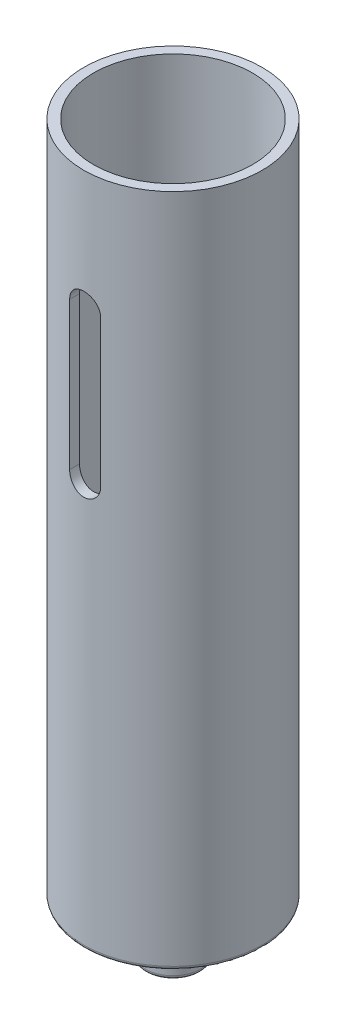
ISO-10303-21;
HEADER;
FILE_DESCRIPTION(('STEP AP214'),'2;1');
FILE_NAME('part.step','',(''),(''),'','','');
FILE_SCHEMA(('AUTOMOTIVE_DESIGN { 1 0 10303 214 1 1 1 1 }'));
ENDSEC;
DATA;
#1=APPLICATION_CONTEXT('core data for automotive mechanical design processes');
#2=APPLICATION_PROTOCOL_DEFINITION('international standard','automotive_design',2000,#1);
#3=PRODUCT_CONTEXT('',#1,'mechanical');
#4=PRODUCT('Part','Part','',(#3));
#5=PRODUCT_RELATED_PRODUCT_CATEGORY('part','',(#4));
#6=PRODUCT_DEFINITION_FORMATION('','',#4);
#7=PRODUCT_DEFINITION_CONTEXT('part definition',#1,'design');
#8=PRODUCT_DEFINITION('design','',#6,#7);
#9=PRODUCT_DEFINITION_SHAPE('','',#8);
#10=(LENGTH_UNIT() NAMED_UNIT(*) SI_UNIT(.MILLI.,.METRE.));
#11=(NAMED_UNIT(*) PLANE_ANGLE_UNIT() SI_UNIT($,.RADIAN.));
#12=(NAMED_UNIT(*) SI_UNIT($,.STERADIAN.) SOLID_ANGLE_UNIT());
#13=UNCERTAINTY_MEASURE_WITH_UNIT(LENGTH_MEASURE(1.E-05),#10,'distance_accuracy_value','');
#14=(GEOMETRIC_REPRESENTATION_CONTEXT(3) GLOBAL_UNCERTAINTY_ASSIGNED_CONTEXT((#13)) GLOBAL_UNIT_ASSIGNED_CONTEXT((#10,
#11,#12)) REPRESENTATION_CONTEXT('',''));
#15=CARTESIAN_POINT('',(0.,0.,0.));
#16=DIRECTION('',(0.,0.,1.));
#17=DIRECTION('',(1.,0.,0.));
#18=AXIS2_PLACEMENT_3D('',#15,#16,#17);
#19=CARTESIAN_POINT('',(0.,87.,0.));
#20=DIRECTION('',(0.,-1.,0.));
#21=DIRECTION('',(0.,0.,-1.));
#22=AXIS2_PLACEMENT_3D('',#19,#20,#21);
#23=CYLINDRICAL_SURFACE('',#22,10.25);
#24=CARTESIAN_POINT('',(2.,52.5,10.0529846314416));
#25=CARTESIAN_POINT('',(2.00000026474774,52.4443037438582,10.0529818512377));
#26=CARTESIAN_POINT('',(1.99767197114106,52.3886347089901,10.0534480792729));
#27=CARTESIAN_POINT('',(1.98838764643216,52.2777056971872,10.055289542273));
#28=CARTESIAN_POINT('',(1.98143217044959,52.2224456719878,10.056664668198));
#29=CARTESIAN_POINT('',(1.95371202827703,52.0580508314354,10.06210146268));
#30=CARTESIAN_POINT('',(1.92609332187398,51.9500341345624,10.0674748189029));
#31=CARTESIAN_POINT('',(1.85342199518341,51.7402849984717,10.0811048819969));
#32=CARTESIAN_POINT('',(1.80836714859896,51.6385533636732,10.0893619570564));
#33=CARTESIAN_POINT('',(1.70213759643023,51.4440639321559,10.1078248874847));
#34=CARTESIAN_POINT('',(1.64096144953581,51.3513069388209,10.1180309170755));
#35=CARTESIAN_POINT('',(1.50336058613172,51.1761961972561,10.1393933833315));
#36=CARTESIAN_POINT('',(1.42676233551179,51.093980059334,10.150559722467));
#37=CARTESIAN_POINT('',(1.26085794813628,50.9434708337091,10.172498541661));
#38=CARTESIAN_POINT('',(1.17154984994044,50.8751798989705,10.1832709606047));
#39=CARTESIAN_POINT('',(0.981850523573934,50.753934808158,10.2033145114834));
#40=CARTESIAN_POINT('',(0.881373816553729,50.7011120368576,10.212572503359));
#41=CARTESIAN_POINT('',(0.672766327683913,50.613152159665,10.2284315918507));
#42=CARTESIAN_POINT('',(0.564636648888219,50.5780125109298,10.2350330704475));
#43=CARTESIAN_POINT('',(0.345226874612462,50.5268430256144,10.2447655226638));
#44=CARTESIAN_POINT('',(0.234003304952567,50.5105790279144,10.2479389873593));
#45=CARTESIAN_POINT('',(0.01036136208437,50.4968922107862,10.2506045196876));
#46=CARTESIAN_POINT('',(-0.102056928601051,50.4994680983702,10.2500968399588));
#47=CARTESIAN_POINT('',(-0.323283785408644,50.5232102498542,10.2454901815369));
#48=CARTESIAN_POINT('',(-0.432120631896837,50.544123846148,10.2414400151616));
#49=CARTESIAN_POINT('',(-0.644709125095129,50.6035472900919,10.2302584409063));
#50=CARTESIAN_POINT('',(-0.748460611696426,50.642057691371,10.2231269360817));
#51=CARTESIAN_POINT('',(-0.948661299857947,50.7358189426263,10.2065029605881));
#52=CARTESIAN_POINT('',(-1.04506242449343,50.7911698539017,10.1969964403882));
#53=CARTESIAN_POINT('',(-1.22729891218388,50.9169653317526,10.1766722023355));
#54=CARTESIAN_POINT('',(-1.31313346298695,50.9874110575262,10.16585438381));
#55=CARTESIAN_POINT('',(-1.47329233366574,51.142774558763,10.1438928677922));
#56=CARTESIAN_POINT('',(-1.54740363577462,51.2279117158987,10.1327467378672));
#57=CARTESIAN_POINT('',(-1.68034975325842,51.4095455736973,10.1115514240507));
#58=CARTESIAN_POINT('',(-1.73918032150545,51.5060454216989,10.1015025455782));
#59=CARTESIAN_POINT('',(-1.83996499115779,51.7079761492387,10.0836335426808));
#60=CARTESIAN_POINT('',(-1.88187627333621,51.813428881313,10.0758190875049));
#61=CARTESIAN_POINT('',(-1.9472669955486,52.029997762423,10.0633879913991));
#62=CARTESIAN_POINT('',(-1.9707739021778,52.1411052074376,10.0587665863936));
#63=CARTESIAN_POINT('',(-1.98981842686514,52.294245366103,10.0550056000148));
#64=CARTESIAN_POINT('',(-1.99363788270108,52.3353358711925,10.0542485447647));
#65=CARTESIAN_POINT('',(-1.99872545093758,52.4176114368517,10.0532384947413));
#66=CARTESIAN_POINT('',(-1.99999783890398,52.4587962225864,10.0529846552656));
#67=CARTESIAN_POINT('',(-2.,52.5,10.0529846314416));
#68=B_SPLINE_CURVE_WITH_KNOTS('',3,(#24,#25,#26,#27,#28,#29,#30,#31,#32,#33,#34,#35,#36,#37,#38,
#39,#40,#41,#42,#43,#44,#45,#46,#47,#48,#49,#50,#51,#52,#53,#54,#55,#56,#57,#58,#59,#60,#61,#62,
#63,#64,#65,#66,#67),.UNSPECIFIED.,.F.,.F.,(4,2,2,2,2,2,2,2,2,2,2,2,2,2,2,2,2,2,2,2,2,4),(0.,
0.166984414418493,0.333948799451815,0.667086576052713,1.00026690269221,1.33347702712651,
1.67067021644531,2.00791549946079,2.34794732267791,2.68793023514507,3.02364883228466,
3.35934438915662,3.69048596299376,4.02163795589081,4.35479730819768,4.68798225447393,
5.02665849113204,5.36542875899523,5.70505108924443,6.0441655975835,6.1679265595979,
6.29147959886261),.UNSPECIFIED.);
#69=CARTESIAN_POINT('',(2.,52.5,10.0529846314416));
#70=VERTEX_POINT('',#69);
#71=CARTESIAN_POINT('',(-2.,52.5,10.0529846314416));
#72=VERTEX_POINT('',#71);
#73=EDGE_CURVE('E235',#70,#72,#68,.T.);
#74=ORIENTED_EDGE('',*,*,#73,.F.);
#75=DIRECTION('',(0.,-1.,0.));
#76=VECTOR('',#75,1.);
#77=CARTESIAN_POINT('',(2.,87.,10.0529846314416));
#78=LINE('',#77,#76);
#79=CARTESIAN_POINT('',(2.,71.5,10.0529846314416));
#80=VERTEX_POINT('',#79);
#81=EDGE_CURVE('E117',#80,#70,#78,.T.);
#82=ORIENTED_EDGE('',*,*,#81,.F.);
#83=CARTESIAN_POINT('',(-2.,71.5,10.0529846314416));
#84=CARTESIAN_POINT('',(-2.00000026474775,71.5556962561418,10.0529818512377));
#85=CARTESIAN_POINT('',(-1.99767197114107,71.6113652910098,10.0534480792729));
#86=CARTESIAN_POINT('',(-1.98838764643216,71.7222943028127,10.055289542273));
#87=CARTESIAN_POINT('',(-1.98143217044959,71.7775543280122,10.056664668198));
#88=CARTESIAN_POINT('',(-1.95371202827703,71.9419491685646,10.06210146268));
#89=CARTESIAN_POINT('',(-1.92609332187399,72.0499658654376,10.0674748189029));
#90=CARTESIAN_POINT('',(-1.85342199518342,72.2597150015283,10.0811048819969));
#91=CARTESIAN_POINT('',(-1.80836714859896,72.3614466363268,10.0893619570564));
#92=CARTESIAN_POINT('',(-1.70213759643023,72.5559360678441,10.1078248874847));
#93=CARTESIAN_POINT('',(-1.64096144953581,72.6486930611791,10.1180309170755));
#94=CARTESIAN_POINT('',(-1.50336058613172,72.8238038027439,10.1393933833315));
#95=CARTESIAN_POINT('',(-1.42676233551178,72.906019940666,10.150559722467));
#96=CARTESIAN_POINT('',(-1.26085794813628,73.0565291662909,10.172498541661));
#97=CARTESIAN_POINT('',(-1.17154984994044,73.1248201010295,10.1832709606047));
#98=CARTESIAN_POINT('',(-0.981850523573938,73.246065191842,10.2033145114834));
#99=CARTESIAN_POINT('',(-0.881373816553735,73.2988879631424,10.212572503359));
#100=CARTESIAN_POINT('',(-0.672766327683919,73.386847840335,10.2284315918507));
#101=CARTESIAN_POINT('',(-0.564636648888224,73.4219874890702,10.2350330704475));
#102=CARTESIAN_POINT('',(-0.345226874612466,73.4731569743855,10.2447655226638));
#103=CARTESIAN_POINT('',(-0.234003304952569,73.4894209720856,10.2479389873593));
#104=CARTESIAN_POINT('',(-0.0103613620843715,73.5031077892138,10.2506045196876));
#105=CARTESIAN_POINT('',(0.102056928601051,73.5005319016298,10.2500968399588));
#106=CARTESIAN_POINT('',(0.323283785408643,73.4767897501458,10.2454901815369));
#107=CARTESIAN_POINT('',(0.432120631896835,73.455876153852,10.2414400151616));
#108=CARTESIAN_POINT('',(0.644709125095127,73.396452709908,10.2302584409063));
#109=CARTESIAN_POINT('',(0.748460611696426,73.357942308629,10.2231269360817));
#110=CARTESIAN_POINT('',(0.94866129985795,73.2641810573737,10.2065029605881));
#111=CARTESIAN_POINT('',(1.04506242449343,73.2088301460983,10.1969964403882));
#112=CARTESIAN_POINT('',(1.22729891218389,73.0830346682474,10.1766722023355));
#113=CARTESIAN_POINT('',(1.31313346298695,73.0125889424738,10.16585438381));
#114=CARTESIAN_POINT('',(1.47329233366574,72.857225441237,10.1438928677922));
#115=CARTESIAN_POINT('',(1.54740363577463,72.7720882841013,10.1327467378672));
#116=CARTESIAN_POINT('',(1.68034975325843,72.5904544263027,10.1115514240507));
#117=CARTESIAN_POINT('',(1.73918032150545,72.493954578301,10.1015025455782));
#118=CARTESIAN_POINT('',(1.83996499115779,72.2920238507613,10.0836335426808));
#119=CARTESIAN_POINT('',(1.88187627333621,72.186571118687,10.0758190875049));
#120=CARTESIAN_POINT('',(1.9472669955486,71.970002237577,10.0633879913991));
#121=CARTESIAN_POINT('',(1.9707739021778,71.8588947925624,10.0587665863936));
#122=CARTESIAN_POINT('',(1.98981842686514,71.7057546338969,10.0550056000148));
#123=CARTESIAN_POINT('',(1.99363788270108,71.6646641288075,10.0542485447647));
#124=CARTESIAN_POINT('',(1.99872545093759,71.5823885631482,10.0532384947413));
#125=CARTESIAN_POINT('',(1.99999783890398,71.5412037774136,10.0529846552656));
#126=CARTESIAN_POINT('',(2.,71.5,10.0529846314416));
#127=B_SPLINE_CURVE_WITH_KNOTS('',3,(#83,#84,#85,#86,#87,#88,#89,#90,#91,#92,#93,#94,#95,#96,
#97,#98,#99,#100,#101,#102,#103,#104,#105,#106,#107,#108,#109,#110,#111,#112,#113,#114,#115,
#116,#117,#118,#119,#120,#121,#122,#123,#124,#125,#126),.UNSPECIFIED.,.F.,.F.,(4,2,2,2,2,2,2,2,
2,2,2,2,2,2,2,2,2,2,2,2,2,4),(0.,0.166984414418472,0.333948799451794,0.667086576052713,
1.00026690269221,1.33347702712653,1.67067021644531,2.00791549946079,2.3479473226779,
2.68793023514506,3.02364883228466,3.35934438915663,3.69048596299376,4.02163795589082,
4.3547973081977,4.68798225447394,5.02665849113205,5.36542875899524,5.70505108924441,
6.04416559758352,6.16792655959792,6.29147959886264),.UNSPECIFIED.);
#128=CARTESIAN_POINT('',(-2.,71.5,10.0529846314416));
#129=VERTEX_POINT('',#128);
#130=EDGE_CURVE('E134',#129,#80,#127,.T.);
#131=ORIENTED_EDGE('',*,*,#130,.F.);
#132=DIRECTION('',(0.,-1.,0.));
#133=VECTOR('',#132,1.);
#134=CARTESIAN_POINT('',(-2.,87.,10.0529846314416));
#135=LINE('',#134,#133);
#136=EDGE_CURVE('E138',#72,#129,#135,.F.);
#137=ORIENTED_EDGE('',*,*,#136,.F.);
#138=EDGE_LOOP('',(#74,#82,#131,#137));
#139=FACE_BOUND('',#138,.T.);
#140=CARTESIAN_POINT('',(-2.,52.5,-10.0529846314416));
#141=CARTESIAN_POINT('',(-2.00000026474774,52.4443037438582,-10.0529818512377));
#142=CARTESIAN_POINT('',(-1.99767197114106,52.3886347089901,-10.0534480792729));
#143=CARTESIAN_POINT('',(-1.98838764643216,52.2777056971872,-10.055289542273));
#144=CARTESIAN_POINT('',(-1.98143217044959,52.2224456719878,-10.056664668198));
#145=CARTESIAN_POINT('',(-1.95371202827703,52.0580508314354,-10.06210146268));
#146=CARTESIAN_POINT('',(-1.92609332187398,51.9500341345624,-10.0674748189029));
#147=CARTESIAN_POINT('',(-1.85342199518341,51.7402849984717,-10.0811048819969));
#148=CARTESIAN_POINT('',(-1.80836714859896,51.6385533636732,-10.0893619570564));
#149=CARTESIAN_POINT('',(-1.70213759643023,51.4440639321559,-10.1078248874847));
#150=CARTESIAN_POINT('',(-1.64096144953581,51.3513069388209,-10.1180309170755));
#151=CARTESIAN_POINT('',(-1.50336058613172,51.1761961972561,-10.1393933833315));
#152=CARTESIAN_POINT('',(-1.42676233551179,51.093980059334,-10.150559722467));
#153=CARTESIAN_POINT('',(-1.26085794813628,50.9434708337091,-10.172498541661));
#154=CARTESIAN_POINT('',(-1.17154984994044,50.8751798989705,-10.1832709606047));
#155=CARTESIAN_POINT('',(-0.981850523573934,50.753934808158,-10.2033145114834));
#156=CARTESIAN_POINT('',(-0.881373816553729,50.7011120368576,-10.212572503359));
#157=CARTESIAN_POINT('',(-0.672766327683913,50.613152159665,-10.2284315918507));
#158=CARTESIAN_POINT('',(-0.564636648888219,50.5780125109298,-10.2350330704475));
#159=CARTESIAN_POINT('',(-0.345226874612462,50.5268430256144,-10.2447655226638));
#160=CARTESIAN_POINT('',(-0.234003304952567,50.5105790279144,-10.2479389873593));
#161=CARTESIAN_POINT('',(-0.01036136208437,50.4968922107862,-10.2506045196876));
#162=CARTESIAN_POINT('',(0.102056928601051,50.4994680983702,-10.2500968399588));
#163=CARTESIAN_POINT('',(0.323283785408644,50.5232102498542,-10.2454901815369));
#164=CARTESIAN_POINT('',(0.432120631896837,50.544123846148,-10.2414400151616));
#165=CARTESIAN_POINT('',(0.644709125095129,50.6035472900919,-10.2302584409063));
#166=CARTESIAN_POINT('',(0.748460611696426,50.642057691371,-10.2231269360817));
#167=CARTESIAN_POINT('',(0.948661299857947,50.7358189426263,-10.2065029605881));
#168=CARTESIAN_POINT('',(1.04506242449343,50.7911698539017,-10.1969964403882));
#169=CARTESIAN_POINT('',(1.22729891218388,50.9169653317526,-10.1766722023355));
#170=CARTESIAN_POINT('',(1.31313346298695,50.9874110575262,-10.16585438381));
#171=CARTESIAN_POINT('',(1.47329233366574,51.142774558763,-10.1438928677922));
#172=CARTESIAN_POINT('',(1.54740363577462,51.2279117158987,-10.1327467378672));
#173=CARTESIAN_POINT('',(1.68034975325842,51.4095455736973,-10.1115514240507));
#174=CARTESIAN_POINT('',(1.73918032150545,51.5060454216989,-10.1015025455782));
#175=CARTESIAN_POINT('',(1.83996499115779,51.7079761492387,-10.0836335426808));
#176=CARTESIAN_POINT('',(1.88187627333621,51.813428881313,-10.0758190875049));
#177=CARTESIAN_POINT('',(1.9472669955486,52.029997762423,-10.0633879913991));
#178=CARTESIAN_POINT('',(1.9707739021778,52.1411052074376,-10.0587665863936));
#179=CARTESIAN_POINT('',(1.98981842686514,52.294245366103,-10.0550056000148));
#180=CARTESIAN_POINT('',(1.99363788270108,52.3353358711925,-10.0542485447647));
#181=CARTESIAN_POINT('',(1.99872545093758,52.4176114368517,-10.0532384947413));
#182=CARTESIAN_POINT('',(1.99999783890398,52.4587962225864,-10.0529846552656));
#183=CARTESIAN_POINT('',(2.,52.5,-10.0529846314416));
#184=B_SPLINE_CURVE_WITH_KNOTS('',3,(#140,#141,#142,#143,#144,#145,#146,#147,#148,#149,#150,
#151,#152,#153,#154,#155,#156,#157,#158,#159,#160,#161,#162,#163,#164,#165,#166,#167,#168,#169,
#170,#171,#172,#173,#174,#175,#176,#177,#178,#179,#180,#181,#182,#183),.UNSPECIFIED.,.F.,.F.,(4,
2,2,2,2,2,2,2,2,2,2,2,2,2,2,2,2,2,2,2,2,4),(0.,0.166984414418493,0.333948799451815,
0.667086576052713,1.00026690269221,1.33347702712651,1.67067021644531,2.00791549946079,
2.34794732267791,2.68793023514507,3.02364883228466,3.35934438915662,3.69048596299376,
4.02163795589081,4.35479730819768,4.68798225447393,5.02665849113204,5.36542875899523,
5.70505108924443,6.0441655975835,6.1679265595979,6.29147959886261),.UNSPECIFIED.);
#185=CARTESIAN_POINT('',(-2.,52.5,-10.0529846314416));
#186=VERTEX_POINT('',#185);
#187=CARTESIAN_POINT('',(2.,52.5,-10.0529846314416));
#188=VERTEX_POINT('',#187);
#189=EDGE_CURVE('E228',#186,#188,#184,.T.);
#190=ORIENTED_EDGE('',*,*,#189,.F.);
#191=DIRECTION('',(0.,-1.,0.));
#192=VECTOR('',#191,1.);
#193=CARTESIAN_POINT('',(-2.,87.,-10.0529846314416));
#194=LINE('',#193,#192);
#195=CARTESIAN_POINT('',(-2.,71.5,-10.0529846314416));
#196=VERTEX_POINT('',#195);
#197=EDGE_CURVE('E132',#196,#186,#194,.T.);
#198=ORIENTED_EDGE('',*,*,#197,.F.);
#199=CARTESIAN_POINT('',(2.,71.5,-10.0529846314416));
#200=CARTESIAN_POINT('',(2.00000026474775,71.5556962561418,-10.0529818512377));
#201=CARTESIAN_POINT('',(1.99767197114107,71.6113652910098,-10.0534480792729));
#202=CARTESIAN_POINT('',(1.98838764643216,71.7222943028127,-10.055289542273));
#203=CARTESIAN_POINT('',(1.98143217044959,71.7775543280122,-10.056664668198));
#204=CARTESIAN_POINT('',(1.95371202827703,71.9419491685646,-10.06210146268));
#205=CARTESIAN_POINT('',(1.92609332187399,72.0499658654376,-10.0674748189029));
#206=CARTESIAN_POINT('',(1.85342199518342,72.2597150015283,-10.0811048819969));
#207=CARTESIAN_POINT('',(1.80836714859896,72.3614466363268,-10.0893619570564));
#208=CARTESIAN_POINT('',(1.70213759643023,72.5559360678441,-10.1078248874847));
#209=CARTESIAN_POINT('',(1.64096144953581,72.6486930611791,-10.1180309170755));
#210=CARTESIAN_POINT('',(1.50336058613172,72.8238038027439,-10.1393933833315));
#211=CARTESIAN_POINT('',(1.42676233551178,72.906019940666,-10.150559722467));
#212=CARTESIAN_POINT('',(1.26085794813628,73.0565291662909,-10.172498541661));
#213=CARTESIAN_POINT('',(1.17154984994044,73.1248201010295,-10.1832709606047));
#214=CARTESIAN_POINT('',(0.981850523573938,73.246065191842,-10.2033145114834));
#215=CARTESIAN_POINT('',(0.881373816553735,73.2988879631424,-10.212572503359));
#216=CARTESIAN_POINT('',(0.672766327683919,73.386847840335,-10.2284315918507));
#217=CARTESIAN_POINT('',(0.564636648888224,73.4219874890702,-10.2350330704475));
#218=CARTESIAN_POINT('',(0.345226874612466,73.4731569743855,-10.2447655226638));
#219=CARTESIAN_POINT('',(0.234003304952569,73.4894209720856,-10.2479389873593));
#220=CARTESIAN_POINT('',(0.0103613620843715,73.5031077892138,-10.2506045196876));
#221=CARTESIAN_POINT('',(-0.102056928601051,73.5005319016298,-10.2500968399588));
#222=CARTESIAN_POINT('',(-0.323283785408643,73.4767897501458,-10.2454901815369));
#223=CARTESIAN_POINT('',(-0.432120631896835,73.455876153852,-10.2414400151616));
#224=CARTESIAN_POINT('',(-0.644709125095127,73.396452709908,-10.2302584409063));
#225=CARTESIAN_POINT('',(-0.748460611696426,73.357942308629,-10.2231269360817));
#226=CARTESIAN_POINT('',(-0.94866129985795,73.2641810573737,-10.2065029605881));
#227=CARTESIAN_POINT('',(-1.04506242449343,73.2088301460983,-10.1969964403882));
#228=CARTESIAN_POINT('',(-1.22729891218389,73.0830346682474,-10.1766722023355));
#229=CARTESIAN_POINT('',(-1.31313346298695,73.0125889424738,-10.16585438381));
#230=CARTESIAN_POINT('',(-1.47329233366574,72.857225441237,-10.1438928677922));
#231=CARTESIAN_POINT('',(-1.54740363577463,72.7720882841013,-10.1327467378672));
#232=CARTESIAN_POINT('',(-1.68034975325843,72.5904544263027,-10.1115514240507));
#233=CARTESIAN_POINT('',(-1.73918032150545,72.493954578301,-10.1015025455782));
#234=CARTESIAN_POINT('',(-1.83996499115779,72.2920238507613,-10.0836335426808));
#235=CARTESIAN_POINT('',(-1.88187627333621,72.186571118687,-10.0758190875049));
#236=CARTESIAN_POINT('',(-1.9472669955486,71.970002237577,-10.0633879913991));
#237=CARTESIAN_POINT('',(-1.9707739021778,71.8588947925624,-10.0587665863936));
#238=CARTESIAN_POINT('',(-1.98981842686514,71.7057546338969,-10.0550056000148));
#239=CARTESIAN_POINT('',(-1.99363788270108,71.6646641288075,-10.0542485447647));
#240=CARTESIAN_POINT('',(-1.99872545093759,71.5823885631482,-10.0532384947413));
#241=CARTESIAN_POINT('',(-1.99999783890398,71.5412037774136,-10.0529846552656));
#242=CARTESIAN_POINT('',(-2.,71.5,-10.0529846314416));
#243=B_SPLINE_CURVE_WITH_KNOTS('',3,(#199,#200,#201,#202,#203,#204,#205,#206,#207,#208,#209,
#210,#211,#212,#213,#214,#215,#216,#217,#218,#219,#220,#221,#222,#223,#224,#225,#226,#227,#228,
#229,#230,#231,#232,#233,#234,#235,#236,#237,#238,#239,#240,#241,#242),.UNSPECIFIED.,.F.,.F.,(4,
2,2,2,2,2,2,2,2,2,2,2,2,2,2,2,2,2,2,2,2,4),(0.,0.166984414418472,0.333948799451794,
0.667086576052713,1.00026690269221,1.33347702712653,1.67067021644531,2.00791549946079,
2.3479473226779,2.68793023514506,3.02364883228466,3.35934438915663,3.69048596299376,
4.02163795589082,4.3547973081977,4.68798225447394,5.02665849113205,5.36542875899524,
5.70505108924441,6.04416559758352,6.16792655959792,6.29147959886264),.UNSPECIFIED.);
#244=CARTESIAN_POINT('',(2.,71.5,-10.0529846314416));
#245=VERTEX_POINT('',#244);
#246=EDGE_CURVE('E123',#245,#196,#243,.T.);
#247=ORIENTED_EDGE('',*,*,#246,.F.);
#248=DIRECTION('',(0.,-1.,0.));
#249=VECTOR('',#248,1.);
#250=CARTESIAN_POINT('',(2.,87.,-10.0529846314416));
#251=LINE('',#250,#249);
#252=EDGE_CURVE('E108',#188,#245,#251,.F.);
#253=ORIENTED_EDGE('',*,*,#252,.F.);
#254=EDGE_LOOP('',(#190,#198,#247,#253));
#255=FACE_BOUND('',#254,.T.);
#256=CARTESIAN_POINT('',(0.,87.,0.));
#257=DIRECTION('',(0.,1.,0.));
#258=DIRECTION('',(0.,0.,1.));
#259=AXIS2_PLACEMENT_3D('',#256,#257,#258);
#260=CIRCLE('',#259,10.25);
#261=CARTESIAN_POINT('',(0.,87.,10.25));
#262=VERTEX_POINT('',#261);
#263=EDGE_CURVE('E246',#262,#262,#260,.T.);
#264=ORIENTED_EDGE('',*,*,#263,.T.);
#265=EDGE_LOOP('',(#264));
#266=FACE_BOUND('',#265,.T.);
#267=CARTESIAN_POINT('',(0.,1.35,0.));
#268=DIRECTION('',(0.,-1.,0.));
#269=DIRECTION('',(0.,0.,-1.));
#270=AXIS2_PLACEMENT_3D('',#267,#268,#269);
#271=CIRCLE('',#270,10.25);
#272=CARTESIAN_POINT('',(0.,1.35,-10.25));
#273=VERTEX_POINT('',#272);
#274=EDGE_CURVE('E242',#273,#273,#271,.T.);
#275=ORIENTED_EDGE('',*,*,#274,.T.);
#276=EDGE_LOOP('',(#275));
#277=FACE_BOUND('',#276,.T.);
#278=ADVANCED_FACE('F43',(#139,#255,#266,#277),#23,.F.);
#279=CARTESIAN_POINT('',(0.,87.,0.));
#280=DIRECTION('',(0.,1.,0.));
#281=DIRECTION('',(0.,0.,1.));
#282=AXIS2_PLACEMENT_3D('',#279,#280,#281);
#283=PLANE('',#282);
#284=CARTESIAN_POINT('',(0.,87.,0.));
#285=DIRECTION('',(0.,1.,0.));
#286=DIRECTION('',(0.,0.,1.));
#287=AXIS2_PLACEMENT_3D('',#284,#285,#286);
#288=CIRCLE('',#287,11.5);
#289=CARTESIAN_POINT('',(0.,87.,11.5));
#290=VERTEX_POINT('',#289);
#291=EDGE_CURVE('E249',#290,#290,#288,.T.);
#292=ORIENTED_EDGE('',*,*,#291,.T.);
#293=EDGE_LOOP('',(#292));
#294=FACE_BOUND('',#293,.T.);
#295=ORIENTED_EDGE('',*,*,#263,.F.);
#296=EDGE_LOOP('',(#295));
#297=FACE_BOUND('',#296,.T.);
#298=ADVANCED_FACE('F337',(#294,#297),#283,.T.);
#299=CARTESIAN_POINT('',(0.,0.,0.));
#300=DIRECTION('',(0.,1.,0.));
#301=DIRECTION('',(0.,0.,1.));
#302=AXIS2_PLACEMENT_3D('',#299,#300,#301);
#303=PLANE('',#302);
#304=CARTESIAN_POINT('',(0.,0.,0.));
#305=DIRECTION('',(0.,1.,0.));
#306=DIRECTION('',(0.,0.,1.));
#307=AXIS2_PLACEMENT_3D('',#304,#305,#306);
#308=CIRCLE('',#307,4.05);
#309=CARTESIAN_POINT('',(0.,0.,4.05));
#310=VERTEX_POINT('',#309);
#311=EDGE_CURVE('E52',#310,#310,#308,.T.);
#312=ORIENTED_EDGE('',*,*,#311,.T.);
#313=EDGE_LOOP('',(#312));
#314=FACE_BOUND('',#313,.T.);
#315=CARTESIAN_POINT('',(0.,0.,0.));
#316=DIRECTION('',(0.,1.,0.));
#317=DIRECTION('',(0.,0.,1.));
#318=AXIS2_PLACEMENT_3D('',#315,#316,#317);
#319=CIRCLE('',#318,11.);
#320=CARTESIAN_POINT('',(0.,0.,11.));
#321=VERTEX_POINT('',#320);
#322=EDGE_CURVE('E313',#321,#321,#319,.F.);
#323=ORIENTED_EDGE('',*,*,#322,.T.);
#324=EDGE_LOOP('',(#323));
#325=FACE_BOUND('',#324,.T.);
#326=ADVANCED_FACE('F195',(#314,#325),#303,.F.);
#327=CARTESIAN_POINT('',(0.,87.,0.));
#328=DIRECTION('',(0.,-1.,0.));
#329=DIRECTION('',(0.,0.,-1.));
#330=AXIS2_PLACEMENT_3D('',#327,#328,#329);
#331=CYLINDRICAL_SURFACE('',#330,11.5);
#332=CARTESIAN_POINT('',(0.,0.5,0.));
#333=DIRECTION('',(0.,1.,0.));
#334=DIRECTION('',(0.,0.,1.));
#335=AXIS2_PLACEMENT_3D('',#332,#333,#334);
#336=CIRCLE('',#335,11.5);
#337=CARTESIAN_POINT('',(0.,0.5,11.5));
#338=VERTEX_POINT('',#337);
#339=EDGE_CURVE('E11',#338,#338,#336,.T.);
#340=ORIENTED_EDGE('',*,*,#339,.T.);
#341=EDGE_LOOP('',(#340));
#342=FACE_BOUND('',#341,.T.);
#343=DIRECTION('',(0.,-1.,0.));
#344=VECTOR('',#343,1.);
#345=CARTESIAN_POINT('',(2.,87.,-11.3247516529061));
#346=LINE('',#345,#344);
#347=CARTESIAN_POINT('',(2.,52.5,-11.3247516529061));
#348=VERTEX_POINT('',#347);
#349=CARTESIAN_POINT('',(2.,71.5,-11.3247516529061));
#350=VERTEX_POINT('',#349);
#351=EDGE_CURVE('E295',#348,#350,#346,.F.);
#352=ORIENTED_EDGE('',*,*,#351,.T.);
#353=CARTESIAN_POINT('',(2.,71.5,-11.3247516529061));
#354=CARTESIAN_POINT('',(2.00000013344785,71.5558143287494,-11.324749209412));
#355=CARTESIAN_POINT('',(1.99766209306361,71.6116014939634,-11.3251648019926));
#356=CARTESIAN_POINT('',(1.98833802344695,71.7227681676658,-11.3268064825984));
#357=CARTESIAN_POINT('',(1.98135248145872,71.7781477182733,-11.3280324856601));
#358=CARTESIAN_POINT('',(1.95350749173362,71.9429194600327,-11.3328807322808));
#359=CARTESIAN_POINT('',(1.92575938713005,72.0511945593326,-11.3376734358723));
#360=CARTESIAN_POINT('',(1.8527249297421,72.2614578223639,-11.3498353797758));
#361=CARTESIAN_POINT('',(1.80743510992694,72.3634447386461,-11.3572051293997));
#362=CARTESIAN_POINT('',(1.70063208178705,72.558394114657,-11.3736871667194));
#363=CARTESIAN_POINT('',(1.63911836426731,72.6513562910145,-11.3827995091048));
#364=CARTESIAN_POINT('',(1.50092217438734,72.8265756231343,-11.4018476371408));
#365=CARTESIAN_POINT('',(1.42410131871773,72.9087228412203,-11.4117904152975));
#366=CARTESIAN_POINT('',(1.25776149067363,73.0590392570217,-11.4313182143881));
#367=CARTESIAN_POINT('',(1.16824057177883,73.1272063080932,-11.4409031801957));
#368=CARTESIAN_POINT('',(0.978325222106342,73.2480352840241,-11.4587093817976));
#369=CARTESIAN_POINT('',(0.877863887628821,73.3005935317783,-11.4669213471356));
#370=CARTESIAN_POINT('',(0.669377090927081,73.3880437985883,-11.4809771484092));
#371=CARTESIAN_POINT('',(0.561352591865223,73.4229380624957,-11.4868212852447));
#372=CARTESIAN_POINT('',(0.341948929228891,73.4737332923337,-11.4954337757699));
#373=CARTESIAN_POINT('',(0.230614205980004,73.4898210043491,-11.4982323518054));
#374=CARTESIAN_POINT('',(0.00679031943215584,73.5031276669317,-11.5005423784239));
#375=CARTESIAN_POINT('',(-0.105698785726662,73.5003475631598,-11.5000539937504));
#376=CARTESIAN_POINT('',(-0.327354399549199,73.4761416372405,-11.4958688239836));
#377=CARTESIAN_POINT('',(-0.436543662300232,73.4549173200879,-11.4922067133619));
#378=CARTESIAN_POINT('',(-0.649786265860022,73.3947433516146,-11.4821243386804));
#379=CARTESIAN_POINT('',(-0.753839473205585,73.3557932399481,-11.4757040029885));
#380=CARTESIAN_POINT('',(-0.95445304810581,73.2610751531552,-11.4607677618144));
#381=CARTESIAN_POINT('',(-1.0509736756625,73.2052246895221,-11.4522416165296));
#382=CARTESIAN_POINT('',(-1.2333452121733,73.078353727214,-11.4340400217505));
#383=CARTESIAN_POINT('',(-1.31919556842904,73.0073324432389,-11.4243645127722));
#384=CARTESIAN_POINT('',(-1.47897489420528,72.8510314545497,-11.404788855027));
#385=CARTESIAN_POINT('',(-1.55273317017818,72.7655773357171,-11.3948874234686));
#386=CARTESIAN_POINT('',(-1.68491387282839,72.5833887397711,-11.3760950242421));
#387=CARTESIAN_POINT('',(-1.74333195731911,72.486651079911,-11.3672043430794));
#388=CARTESIAN_POINT('',(-1.84321324609719,72.284420228093,-11.3514376399301));
#389=CARTESIAN_POINT('',(-1.88464459919745,72.1789110302743,-11.3445654094435));
#390=CARTESIAN_POINT('',(-1.94908869641428,71.9623554235576,-11.3336728149157));
#391=CARTESIAN_POINT('',(-1.97212894965376,71.8513175496904,-11.3296481924945));
#392=CARTESIAN_POINT('',(-1.9904273770611,71.6995218881078,-11.3264385809529));
#393=CARTESIAN_POINT('',(-1.99401856057286,71.6596694912383,-11.3258065733924));
#394=CARTESIAN_POINT('',(-1.99880176943236,71.5798839100475,-11.3249635202802));
#395=CARTESIAN_POINT('',(-1.99999782838654,71.539950975113,-11.3247517669878));
#396=CARTESIAN_POINT('',(-2.,71.5,-11.3247516529061));
#397=B_SPLINE_CURVE_WITH_KNOTS('',3,(#353,#354,#355,#356,#357,#358,#359,#360,#361,#362,#363,
#364,#365,#366,#367,#368,#369,#370,#371,#372,#373,#374,#375,#376,#377,#378,#379,#380,#381,#382,
#383,#384,#385,#386,#387,#388,#389,#390,#391,#392,#393,#394,#395,#396),.UNSPECIFIED.,.F.,.F.,(4,
2,2,2,2,2,2,2,2,2,2,2,2,2,2,2,2,2,2,2,2,4),(0.,0.167338779868898,0.334660018699118,
0.668562696249346,1.00253140166909,1.33651059010849,1.67365856736734,2.01085827474799,
2.35025006261629,2.68959870758022,3.0255482544764,3.36148096360009,3.69378906614217,
4.02610579935004,4.36007143309917,4.69405435838694,5.03240752432744,5.37085636135065,
5.70993694042374,6.04850937256089,6.16851009832177,6.28830856147288),.UNSPECIFIED.);
#398=CARTESIAN_POINT('',(-2.,71.5,-11.3247516529061));
#399=VERTEX_POINT('',#398);
#400=EDGE_CURVE('E126',#350,#399,#397,.T.);
#401=ORIENTED_EDGE('',*,*,#400,.T.);
#402=DIRECTION('',(0.,-1.,0.));
#403=VECTOR('',#402,1.);
#404=CARTESIAN_POINT('',(-2.,87.,-11.3247516529061));
#405=LINE('',#404,#403);
#406=CARTESIAN_POINT('',(-2.,52.5,-11.3247516529061));
#407=VERTEX_POINT('',#406);
#408=EDGE_CURVE('E185',#399,#407,#405,.T.);
#409=ORIENTED_EDGE('',*,*,#408,.T.);
#410=CARTESIAN_POINT('',(-2.,52.5,-11.3247516529061));
#411=CARTESIAN_POINT('',(-2.00000013344785,52.4441856712505,-11.324749209412));
#412=CARTESIAN_POINT('',(-1.99766209306361,52.3883985060366,-11.3251648019926));
#413=CARTESIAN_POINT('',(-1.98833802344694,52.2772318323342,-11.3268064825984));
#414=CARTESIAN_POINT('',(-1.98135248145872,52.2218522817267,-11.3280324856601));
#415=CARTESIAN_POINT('',(-1.95350749173362,52.0570805399673,-11.3328807322808));
#416=CARTESIAN_POINT('',(-1.92575938713004,51.9488054406674,-11.3376734358723));
#417=CARTESIAN_POINT('',(-1.85272492974209,51.738542177636,-11.3498353797758));
#418=CARTESIAN_POINT('',(-1.80743510992693,51.6365552613539,-11.3572051293997));
#419=CARTESIAN_POINT('',(-1.70063208178704,51.441605885343,-11.3736871667194));
#420=CARTESIAN_POINT('',(-1.6391183642673,51.3486437089854,-11.3827995091048));
#421=CARTESIAN_POINT('',(-1.50092217438733,51.1734243768657,-11.4018476371408));
#422=CARTESIAN_POINT('',(-1.42410131871772,51.0912771587797,-11.4117904152975));
#423=CARTESIAN_POINT('',(-1.25776149067362,50.9409607429782,-11.4313182143881));
#424=CARTESIAN_POINT('',(-1.16824057177883,50.8727936919068,-11.4409031801957));
#425=CARTESIAN_POINT('',(-0.978325222106331,50.7519647159759,-11.4587093817976));
#426=CARTESIAN_POINT('',(-0.877863887628808,50.6994064682217,-11.4669213471356));
#427=CARTESIAN_POINT('',(-0.669377090927066,50.6119562014117,-11.4809771484092));
#428=CARTESIAN_POINT('',(-0.561352591865206,50.5770619375043,-11.4868212852447));
#429=CARTESIAN_POINT('',(-0.341948929228874,50.5262667076663,-11.4954337757699));
#430=CARTESIAN_POINT('',(-0.230614205979989,50.5101789956509,-11.4982323518054));
#431=CARTESIAN_POINT('',(-0.00679031943214501,50.4968723330683,-11.5005423784239));
#432=CARTESIAN_POINT('',(0.10569878572667,50.4996524368402,-11.5000539937504));
#433=CARTESIAN_POINT('',(0.327354399549206,50.5238583627595,-11.4958688239836));
#434=CARTESIAN_POINT('',(0.436543662300241,50.5450826799121,-11.4922067133619));
#435=CARTESIAN_POINT('',(0.649786265860031,50.6052566483854,-11.4821243386804));
#436=CARTESIAN_POINT('',(0.753839473205591,50.6442067600519,-11.4757040029885));
#437=CARTESIAN_POINT('',(0.954453048105816,50.7389248468448,-11.4607677618144));
#438=CARTESIAN_POINT('',(1.0509736756625,50.7947753104779,-11.4522416165296));
#439=CARTESIAN_POINT('',(1.23334521217331,50.921646272786,-11.4340400217505));
#440=CARTESIAN_POINT('',(1.31919556842905,50.992667556761,-11.4243645127722));
#441=CARTESIAN_POINT('',(1.47897489420528,51.1489685454503,-11.404788855027));
#442=CARTESIAN_POINT('',(1.55273317017819,51.2344226642829,-11.3948874234686));
#443=CARTESIAN_POINT('',(1.68491387282839,51.4166112602289,-11.3760950242421));
#444=CARTESIAN_POINT('',(1.74333195731911,51.513348920089,-11.3672043430794));
#445=CARTESIAN_POINT('',(1.84321324609719,51.715579771907,-11.3514376399301));
#446=CARTESIAN_POINT('',(1.88464459919745,51.8210889697257,-11.3445654094435));
#447=CARTESIAN_POINT('',(1.94908869641428,52.0376445764424,-11.3336728149157));
#448=CARTESIAN_POINT('',(1.97212894965376,52.1486824503096,-11.3296481924945));
#449=CARTESIAN_POINT('',(1.9904273770611,52.3004781118922,-11.3264385809529));
#450=CARTESIAN_POINT('',(1.99401856057286,52.3403305087616,-11.3258065733924));
#451=CARTESIAN_POINT('',(1.99880176943236,52.4201160899524,-11.3249635202802));
#452=CARTESIAN_POINT('',(1.99999782838653,52.460049024887,-11.3247517669878));
#453=CARTESIAN_POINT('',(2.,52.5,-11.3247516529061));
#454=B_SPLINE_CURVE_WITH_KNOTS('',3,(#410,#411,#412,#413,#414,#415,#416,#417,#418,#419,#420,
#421,#422,#423,#424,#425,#426,#427,#428,#429,#430,#431,#432,#433,#434,#435,#436,#437,#438,#439,
#440,#441,#442,#443,#444,#445,#446,#447,#448,#449,#450,#451,#452,#453),.UNSPECIFIED.,.F.,.F.,(4,
2,2,2,2,2,2,2,2,2,2,2,2,2,2,2,2,2,2,2,2,4),(0.,0.167338779868891,0.334660018699125,
0.668562696249353,1.00253140166912,1.3365105901085,1.67365856736735,2.010858274748,
2.35025006261631,2.68959870758024,3.02554825447641,3.36148096360009,3.69378906614217,
4.02610579935005,4.36007143309917,4.69405435838694,5.03240752432745,5.37085636135066,
5.70993694042376,6.0485093725609,6.16851009832175,6.28830856147288),.UNSPECIFIED.);
#455=EDGE_CURVE('E221',#407,#348,#454,.T.);
#456=ORIENTED_EDGE('',*,*,#455,.T.);
#457=EDGE_LOOP('',(#352,#401,#409,#456));
#458=FACE_BOUND('',#457,.T.);
#459=DIRECTION('',(0.,-1.,0.));
#460=VECTOR('',#459,1.);
#461=CARTESIAN_POINT('',(-2.,87.,11.3247516529061));
#462=LINE('',#461,#460);
#463=CARTESIAN_POINT('',(-2.,52.5,11.3247516529061));
#464=VERTEX_POINT('',#463);
#465=CARTESIAN_POINT('',(-2.,71.5,11.3247516529061));
#466=VERTEX_POINT('',#465);
#467=EDGE_CURVE('E186',#464,#466,#462,.F.);
#468=ORIENTED_EDGE('',*,*,#467,.T.);
#469=CARTESIAN_POINT('',(-2.,71.5,11.3247516529061));
#470=CARTESIAN_POINT('',(-2.00000013344785,71.5558143287494,11.324749209412));
#471=CARTESIAN_POINT('',(-1.99766209306361,71.6116014939634,11.3251648019926));
#472=CARTESIAN_POINT('',(-1.98833802344695,71.7227681676658,11.3268064825984));
#473=CARTESIAN_POINT('',(-1.98135248145872,71.7781477182733,11.3280324856601));
#474=CARTESIAN_POINT('',(-1.95350749173362,71.9429194600327,11.3328807322808));
#475=CARTESIAN_POINT('',(-1.92575938713005,72.0511945593326,11.3376734358723));
#476=CARTESIAN_POINT('',(-1.8527249297421,72.2614578223639,11.3498353797758));
#477=CARTESIAN_POINT('',(-1.80743510992694,72.3634447386461,11.3572051293997));
#478=CARTESIAN_POINT('',(-1.70063208178705,72.558394114657,11.3736871667194));
#479=CARTESIAN_POINT('',(-1.63911836426731,72.6513562910145,11.3827995091048));
#480=CARTESIAN_POINT('',(-1.50092217438734,72.8265756231343,11.4018476371408));
#481=CARTESIAN_POINT('',(-1.42410131871773,72.9087228412203,11.4117904152975));
#482=CARTESIAN_POINT('',(-1.25776149067363,73.0590392570217,11.4313182143881));
#483=CARTESIAN_POINT('',(-1.16824057177883,73.1272063080932,11.4409031801957));
#484=CARTESIAN_POINT('',(-0.978325222106342,73.2480352840241,11.4587093817976));
#485=CARTESIAN_POINT('',(-0.877863887628821,73.3005935317783,11.4669213471356));
#486=CARTESIAN_POINT('',(-0.669377090927081,73.3880437985883,11.4809771484092));
#487=CARTESIAN_POINT('',(-0.561352591865223,73.4229380624957,11.4868212852447));
#488=CARTESIAN_POINT('',(-0.341948929228891,73.4737332923337,11.4954337757699));
#489=CARTESIAN_POINT('',(-0.230614205980004,73.4898210043491,11.4982323518054));
#490=CARTESIAN_POINT('',(-0.00679031943215584,73.5031276669317,11.5005423784239));
#491=CARTESIAN_POINT('',(0.105698785726662,73.5003475631598,11.5000539937504));
#492=CARTESIAN_POINT('',(0.327354399549199,73.4761416372405,11.4958688239836));
#493=CARTESIAN_POINT('',(0.436543662300232,73.4549173200879,11.4922067133619));
#494=CARTESIAN_POINT('',(0.649786265860022,73.3947433516146,11.4821243386804));
#495=CARTESIAN_POINT('',(0.753839473205585,73.3557932399481,11.4757040029885));
#496=CARTESIAN_POINT('',(0.95445304810581,73.2610751531552,11.4607677618144));
#497=CARTESIAN_POINT('',(1.0509736756625,73.2052246895221,11.4522416165296));
#498=CARTESIAN_POINT('',(1.2333452121733,73.078353727214,11.4340400217505));
#499=CARTESIAN_POINT('',(1.31919556842904,73.0073324432389,11.4243645127722));
#500=CARTESIAN_POINT('',(1.47897489420528,72.8510314545497,11.404788855027));
#501=CARTESIAN_POINT('',(1.55273317017818,72.7655773357171,11.3948874234686));
#502=CARTESIAN_POINT('',(1.68491387282839,72.5833887397711,11.3760950242421));
#503=CARTESIAN_POINT('',(1.74333195731911,72.486651079911,11.3672043430794));
#504=CARTESIAN_POINT('',(1.84321324609719,72.284420228093,11.3514376399301));
#505=CARTESIAN_POINT('',(1.88464459919745,72.1789110302743,11.3445654094435));
#506=CARTESIAN_POINT('',(1.94908869641428,71.9623554235576,11.3336728149157));
#507=CARTESIAN_POINT('',(1.97212894965376,71.8513175496904,11.3296481924945));
#508=CARTESIAN_POINT('',(1.9904273770611,71.6995218881078,11.3264385809529));
#509=CARTESIAN_POINT('',(1.99401856057286,71.6596694912383,11.3258065733924));
#510=CARTESIAN_POINT('',(1.99880176943236,71.5798839100475,11.3249635202802));
#511=CARTESIAN_POINT('',(1.99999782838654,71.539950975113,11.3247517669878));
#512=CARTESIAN_POINT('',(2.,71.5,11.3247516529061));
#513=B_SPLINE_CURVE_WITH_KNOTS('',3,(#469,#470,#471,#472,#473,#474,#475,#476,#477,#478,#479,
#480,#481,#482,#483,#484,#485,#486,#487,#488,#489,#490,#491,#492,#493,#494,#495,#496,#497,#498,
#499,#500,#501,#502,#503,#504,#505,#506,#507,#508,#509,#510,#511,#512),.UNSPECIFIED.,.F.,.F.,(4,
2,2,2,2,2,2,2,2,2,2,2,2,2,2,2,2,2,2,2,2,4),(0.,0.167338779868898,0.334660018699118,
0.668562696249346,1.00253140166909,1.33651059010849,1.67365856736734,2.01085827474799,
2.35025006261629,2.68959870758022,3.0255482544764,3.36148096360009,3.69378906614217,
4.02610579935004,4.36007143309917,4.69405435838694,5.03240752432744,5.37085636135065,
5.70993694042374,6.04850937256089,6.16851009832177,6.28830856147288),.UNSPECIFIED.);
#514=CARTESIAN_POINT('',(2.,71.5,11.3247516529061));
#515=VERTEX_POINT('',#514);
#516=EDGE_CURVE('E168',#466,#515,#513,.T.);
#517=ORIENTED_EDGE('',*,*,#516,.T.);
#518=DIRECTION('',(0.,-1.,0.));
#519=VECTOR('',#518,1.);
#520=CARTESIAN_POINT('',(2.,87.,11.3247516529061));
#521=LINE('',#520,#519);
#522=CARTESIAN_POINT('',(2.,52.5,11.3247516529061));
#523=VERTEX_POINT('',#522);
#524=EDGE_CURVE('E208',#515,#523,#521,.T.);
#525=ORIENTED_EDGE('',*,*,#524,.T.);
#526=CARTESIAN_POINT('',(2.,52.5,11.3247516529061));
#527=CARTESIAN_POINT('',(2.00000013344785,52.4441856712505,11.324749209412));
#528=CARTESIAN_POINT('',(1.99766209306361,52.3883985060366,11.3251648019926));
#529=CARTESIAN_POINT('',(1.98833802344694,52.2772318323342,11.3268064825984));
#530=CARTESIAN_POINT('',(1.98135248145872,52.2218522817267,11.3280324856601));
#531=CARTESIAN_POINT('',(1.95350749173362,52.0570805399673,11.3328807322808));
#532=CARTESIAN_POINT('',(1.92575938713004,51.9488054406674,11.3376734358723));
#533=CARTESIAN_POINT('',(1.85272492974209,51.738542177636,11.3498353797758));
#534=CARTESIAN_POINT('',(1.80743510992693,51.6365552613539,11.3572051293997));
#535=CARTESIAN_POINT('',(1.70063208178704,51.441605885343,11.3736871667194));
#536=CARTESIAN_POINT('',(1.6391183642673,51.3486437089854,11.3827995091048));
#537=CARTESIAN_POINT('',(1.50092217438733,51.1734243768657,11.4018476371408));
#538=CARTESIAN_POINT('',(1.42410131871772,51.0912771587797,11.4117904152975));
#539=CARTESIAN_POINT('',(1.25776149067362,50.9409607429782,11.4313182143881));
#540=CARTESIAN_POINT('',(1.16824057177883,50.8727936919068,11.4409031801957));
#541=CARTESIAN_POINT('',(0.978325222106331,50.7519647159759,11.4587093817976));
#542=CARTESIAN_POINT('',(0.877863887628808,50.6994064682217,11.4669213471356));
#543=CARTESIAN_POINT('',(0.669377090927066,50.6119562014117,11.4809771484092));
#544=CARTESIAN_POINT('',(0.561352591865206,50.5770619375043,11.4868212852447));
#545=CARTESIAN_POINT('',(0.341948929228874,50.5262667076663,11.4954337757699));
#546=CARTESIAN_POINT('',(0.230614205979989,50.5101789956509,11.4982323518054));
#547=CARTESIAN_POINT('',(0.00679031943214501,50.4968723330683,11.5005423784239));
#548=CARTESIAN_POINT('',(-0.10569878572667,50.4996524368402,11.5000539937504));
#549=CARTESIAN_POINT('',(-0.327354399549206,50.5238583627595,11.4958688239836));
#550=CARTESIAN_POINT('',(-0.436543662300241,50.5450826799121,11.4922067133619));
#551=CARTESIAN_POINT('',(-0.649786265860031,50.6052566483854,11.4821243386804));
#552=CARTESIAN_POINT('',(-0.753839473205591,50.6442067600519,11.4757040029885));
#553=CARTESIAN_POINT('',(-0.954453048105816,50.7389248468448,11.4607677618144));
#554=CARTESIAN_POINT('',(-1.0509736756625,50.7947753104779,11.4522416165296));
#555=CARTESIAN_POINT('',(-1.23334521217331,50.921646272786,11.4340400217505));
#556=CARTESIAN_POINT('',(-1.31919556842905,50.992667556761,11.4243645127722));
#557=CARTESIAN_POINT('',(-1.47897489420528,51.1489685454503,11.404788855027));
#558=CARTESIAN_POINT('',(-1.55273317017819,51.2344226642829,11.3948874234686));
#559=CARTESIAN_POINT('',(-1.68491387282839,51.4166112602289,11.3760950242421));
#560=CARTESIAN_POINT('',(-1.74333195731911,51.513348920089,11.3672043430794));
#561=CARTESIAN_POINT('',(-1.84321324609719,51.715579771907,11.3514376399301));
#562=CARTESIAN_POINT('',(-1.88464459919745,51.8210889697257,11.3445654094435));
#563=CARTESIAN_POINT('',(-1.94908869641428,52.0376445764424,11.3336728149157));
#564=CARTESIAN_POINT('',(-1.97212894965376,52.1486824503096,11.3296481924945));
#565=CARTESIAN_POINT('',(-1.9904273770611,52.3004781118922,11.3264385809529));
#566=CARTESIAN_POINT('',(-1.99401856057286,52.3403305087616,11.3258065733924));
#567=CARTESIAN_POINT('',(-1.99880176943236,52.4201160899524,11.3249635202802));
#568=CARTESIAN_POINT('',(-1.99999782838653,52.460049024887,11.3247517669878));
#569=CARTESIAN_POINT('',(-2.,52.5,11.3247516529061));
#570=B_SPLINE_CURVE_WITH_KNOTS('',3,(#526,#527,#528,#529,#530,#531,#532,#533,#534,#535,#536,
#537,#538,#539,#540,#541,#542,#543,#544,#545,#546,#547,#548,#549,#550,#551,#552,#553,#554,#555,
#556,#557,#558,#559,#560,#561,#562,#563,#564,#565,#566,#567,#568,#569),.UNSPECIFIED.,.F.,.F.,(4,
2,2,2,2,2,2,2,2,2,2,2,2,2,2,2,2,2,2,2,2,4),(0.,0.167338779868891,0.334660018699125,
0.668562696249353,1.00253140166912,1.3365105901085,1.67365856736735,2.010858274748,
2.35025006261631,2.68959870758024,3.02554825447641,3.36148096360009,3.69378906614217,
4.02610579935005,4.36007143309917,4.69405435838694,5.03240752432745,5.37085636135066,
5.70993694042376,6.0485093725609,6.16851009832175,6.28830856147288),.UNSPECIFIED.);
#571=EDGE_CURVE('E201',#523,#464,#570,.T.);
#572=ORIENTED_EDGE('',*,*,#571,.T.);
#573=EDGE_LOOP('',(#468,#517,#525,#572));
#574=FACE_BOUND('',#573,.T.);
#575=ORIENTED_EDGE('',*,*,#291,.F.);
#576=EDGE_LOOP('',(#575));
#577=FACE_BOUND('',#576,.T.);
#578=ADVANCED_FACE('F189',(#342,#458,#574,#577),#331,.T.);
#579=CARTESIAN_POINT('',(0.,1.35,0.));
#580=DIRECTION('',(0.,-1.,0.));
#581=DIRECTION('',(0.,0.,-1.));
#582=AXIS2_PLACEMENT_3D('',#579,#580,#581);
#583=PLANE('',#582);
#584=ORIENTED_EDGE('',*,*,#274,.F.);
#585=EDGE_LOOP('',(#584));
#586=FACE_BOUND('',#585,.T.);
#587=ADVANCED_FACE('F194',(#586),#583,.F.);
#588=CARTESIAN_POINT('',(0.,-6.66,0.));
#589=DIRECTION('',(0.,1.,0.));
#590=DIRECTION('',(0.,0.,1.));
#591=AXIS2_PLACEMENT_3D('',#588,#589,#590);
#592=CYLINDRICAL_SURFACE('',#591,3.55);
#593=CARTESIAN_POINT('',(0.,-6.16,0.));
#594=DIRECTION('',(0.,-1.,0.));
#595=DIRECTION('',(0.,0.,-1.));
#596=AXIS2_PLACEMENT_3D('',#593,#594,#595);
#597=CIRCLE('',#596,3.55);
#598=CARTESIAN_POINT('',(0.,-6.16,-3.55));
#599=VERTEX_POINT('',#598);
#600=EDGE_CURVE('E309',#599,#599,#597,.F.);
#601=ORIENTED_EDGE('',*,*,#600,.T.);
#602=EDGE_LOOP('',(#601));
#603=FACE_BOUND('',#602,.T.);
#604=CARTESIAN_POINT('',(0.,-0.5,0.));
#605=DIRECTION('',(0.,1.,0.));
#606=DIRECTION('',(0.,0.,1.));
#607=AXIS2_PLACEMENT_3D('',#604,#605,#606);
#608=CIRCLE('',#607,3.55);
#609=CARTESIAN_POINT('',(0.,-0.5,3.55));
#610=VERTEX_POINT('',#609);
#611=EDGE_CURVE('E303',#610,#610,#608,.F.);
#612=ORIENTED_EDGE('',*,*,#611,.T.);
#613=EDGE_LOOP('',(#612));
#614=FACE_BOUND('',#613,.T.);
#615=ADVANCED_FACE('F327',(#603,#614),#592,.T.);
#616=CARTESIAN_POINT('',(0.,-6.66,0.));
#617=DIRECTION('',(0.,-1.,0.));
#618=DIRECTION('',(0.,0.,-1.));
#619=AXIS2_PLACEMENT_3D('',#616,#617,#618);
#620=PLANE('',#619);
#621=CARTESIAN_POINT('',(0.,-6.66,0.));
#622=DIRECTION('',(0.,-1.,0.));
#623=DIRECTION('',(0.,0.,-1.));
#624=AXIS2_PLACEMENT_3D('',#621,#622,#623);
#625=CIRCLE('',#624,3.05);
#626=CARTESIAN_POINT('',(0.,-6.66,-3.05));
#627=VERTEX_POINT('',#626);
#628=EDGE_CURVE('E298',#627,#627,#625,.T.);
#629=ORIENTED_EDGE('',*,*,#628,.T.);
#630=EDGE_LOOP('',(#629));
#631=FACE_BOUND('',#630,.T.);
#632=ADVANCED_FACE('F215',(#631),#620,.T.);
#633=CARTESIAN_POINT('',(2.,71.5,-11.5));
#634=DIRECTION('',(1.,0.,0.));
#635=DIRECTION('',(0.,1.,0.));
#636=AXIS2_PLACEMENT_3D('',#633,#634,#635);
#637=PLANE('',#636);
#638=ORIENTED_EDGE('',*,*,#252,.T.);
#639=DIRECTION('',(0.,0.,1.));
#640=VECTOR('',#639,1.);
#641=CARTESIAN_POINT('',(2.,71.5,-11.5));
#642=LINE('',#641,#640);
#643=EDGE_CURVE('E111',#350,#245,#642,.T.);
#644=ORIENTED_EDGE('',*,*,#643,.F.);
#645=ORIENTED_EDGE('',*,*,#351,.F.);
#646=DIRECTION('',(0.,0.,1.));
#647=VECTOR('',#646,1.);
#648=CARTESIAN_POINT('',(2.,52.5,-11.5));
#649=LINE('',#648,#647);
#650=EDGE_CURVE('E67',#348,#188,#649,.T.);
#651=ORIENTED_EDGE('',*,*,#650,.T.);
#652=EDGE_LOOP('',(#638,#644,#645,#651));
#653=FACE_BOUND('',#652,.T.);
#654=ADVANCED_FACE('F110',(#653),#637,.F.);
#655=CARTESIAN_POINT('',(0.,71.5,-11.5));
#656=DIRECTION('',(0.,0.,1.));
#657=DIRECTION('',(1.,0.,0.));
#658=AXIS2_PLACEMENT_3D('',#655,#656,#657);
#659=CYLINDRICAL_SURFACE('',#658,2.);
#660=ORIENTED_EDGE('',*,*,#246,.T.);
#661=DIRECTION('',(0.,0.,1.));
#662=VECTOR('',#661,1.);
#663=CARTESIAN_POINT('',(-2.,71.5,-11.5));
#664=LINE('',#663,#662);
#665=EDGE_CURVE('E268',#399,#196,#664,.T.);
#666=ORIENTED_EDGE('',*,*,#665,.F.);
#667=ORIENTED_EDGE('',*,*,#400,.F.);
#668=ORIENTED_EDGE('',*,*,#643,.T.);
#669=EDGE_LOOP('',(#660,#666,#667,#668));
#670=FACE_BOUND('',#669,.T.);
#671=ADVANCED_FACE('F121',(#670),#659,.F.);
#672=CARTESIAN_POINT('',(-2.,71.5,-11.5));
#673=DIRECTION('',(-1.,0.,0.));
#674=DIRECTION('',(0.,-1.,0.));
#675=AXIS2_PLACEMENT_3D('',#672,#673,#674);
#676=PLANE('',#675);
#677=ORIENTED_EDGE('',*,*,#197,.T.);
#678=DIRECTION('',(0.,0.,1.));
#679=VECTOR('',#678,1.);
#680=CARTESIAN_POINT('',(-2.,52.5,-11.5));
#681=LINE('',#680,#679);
#682=EDGE_CURVE('E118',#407,#186,#681,.T.);
#683=ORIENTED_EDGE('',*,*,#682,.F.);
#684=ORIENTED_EDGE('',*,*,#408,.F.);
#685=ORIENTED_EDGE('',*,*,#665,.T.);
#686=EDGE_LOOP('',(#677,#683,#684,#685));
#687=FACE_BOUND('',#686,.T.);
#688=ADVANCED_FACE('F163',(#687),#676,.F.);
#689=CARTESIAN_POINT('',(0.,52.5,-11.5));
#690=DIRECTION('',(0.,0.,1.));
#691=DIRECTION('',(1.,0.,0.));
#692=AXIS2_PLACEMENT_3D('',#689,#690,#691);
#693=CYLINDRICAL_SURFACE('',#692,2.);
#694=ORIENTED_EDGE('',*,*,#189,.T.);
#695=ORIENTED_EDGE('',*,*,#650,.F.);
#696=ORIENTED_EDGE('',*,*,#455,.F.);
#697=ORIENTED_EDGE('',*,*,#682,.T.);
#698=EDGE_LOOP('',(#694,#695,#696,#697));
#699=FACE_BOUND('',#698,.T.);
#700=ADVANCED_FACE('F213',(#699),#693,.F.);
#701=ORIENTED_EDGE('',*,*,#73,.T.);
#702=EDGE_CURVE('E271',#72,#464,#681,.T.);
#703=ORIENTED_EDGE('',*,*,#702,.T.);
#704=ORIENTED_EDGE('',*,*,#571,.F.);
#705=EDGE_CURVE('E275',#70,#523,#649,.T.);
#706=ORIENTED_EDGE('',*,*,#705,.F.);
#707=EDGE_LOOP('',(#701,#703,#704,#706));
#708=FACE_BOUND('',#707,.T.);
#709=ADVANCED_FACE('F209',(#708),#693,.F.);
#710=ORIENTED_EDGE('',*,*,#136,.T.);
#711=EDGE_CURVE('E128',#129,#466,#664,.T.);
#712=ORIENTED_EDGE('',*,*,#711,.T.);
#713=ORIENTED_EDGE('',*,*,#467,.F.);
#714=ORIENTED_EDGE('',*,*,#702,.F.);
#715=EDGE_LOOP('',(#710,#712,#713,#714));
#716=FACE_BOUND('',#715,.T.);
#717=ADVANCED_FACE('F161',(#716),#676,.F.);
#718=ORIENTED_EDGE('',*,*,#130,.T.);
#719=EDGE_CURVE('E59',#80,#515,#642,.T.);
#720=ORIENTED_EDGE('',*,*,#719,.T.);
#721=ORIENTED_EDGE('',*,*,#516,.F.);
#722=ORIENTED_EDGE('',*,*,#711,.F.);
#723=EDGE_LOOP('',(#718,#720,#721,#722));
#724=FACE_BOUND('',#723,.T.);
#725=ADVANCED_FACE('F155',(#724),#659,.F.);
#726=ORIENTED_EDGE('',*,*,#81,.T.);
#727=ORIENTED_EDGE('',*,*,#705,.T.);
#728=ORIENTED_EDGE('',*,*,#524,.F.);
#729=ORIENTED_EDGE('',*,*,#719,.F.);
#730=EDGE_LOOP('',(#726,#727,#728,#729));
#731=FACE_BOUND('',#730,.T.);
#732=ADVANCED_FACE('F160',(#731),#637,.F.);
#733=CARTESIAN_POINT('',(0.,-6.16,0.));
#734=DIRECTION('',(0.,-1.,0.));
#735=DIRECTION('',(0.,0.,-1.));
#736=AXIS2_PLACEMENT_3D('',#733,#734,#735);
#737=TOROIDAL_SURFACE('',#736,3.05,0.5);
#738=ORIENTED_EDGE('',*,*,#600,.F.);
#739=EDGE_LOOP('',(#738));
#740=FACE_BOUND('',#739,.T.);
#741=ORIENTED_EDGE('',*,*,#628,.F.);
#742=EDGE_LOOP('',(#741));
#743=FACE_BOUND('',#742,.T.);
#744=ADVANCED_FACE('F197',(#740,#743),#737,.T.);
#745=CARTESIAN_POINT('',(0.,-0.5,0.));
#746=DIRECTION('',(0.,1.,0.));
#747=DIRECTION('',(0.,0.,1.));
#748=AXIS2_PLACEMENT_3D('',#745,#746,#747);
#749=TOROIDAL_SURFACE('',#748,4.05,0.5);
#750=ORIENTED_EDGE('',*,*,#311,.F.);
#751=EDGE_LOOP('',(#750));
#752=FACE_BOUND('',#751,.T.);
#753=ORIENTED_EDGE('',*,*,#611,.F.);
#754=EDGE_LOOP('',(#753));
#755=FACE_BOUND('',#754,.T.);
#756=ADVANCED_FACE('F322',(#752,#755),#749,.F.);
#757=CARTESIAN_POINT('',(0.,0.5,0.));
#758=DIRECTION('',(0.,1.,0.));
#759=DIRECTION('',(0.,0.,1.));
#760=AXIS2_PLACEMENT_3D('',#757,#758,#759);
#761=TOROIDAL_SURFACE('',#760,11.,0.5);
#762=ORIENTED_EDGE('',*,*,#322,.F.);
#763=EDGE_LOOP('',(#762));
#764=FACE_BOUND('',#763,.T.);
#765=ORIENTED_EDGE('',*,*,#339,.F.);
#766=EDGE_LOOP('',(#765));
#767=FACE_BOUND('',#766,.T.);
#768=ADVANCED_FACE('F45',(#764,#767),#761,.T.);
#769=CLOSED_SHELL('',(#278,#298,#326,#578,#587,#615,#632,#654,#671,#688,#700,#709,#717,#725,
#732,#744,#756,#768));
#770=MANIFOLD_SOLID_BREP('B2',#769);
#771=ADVANCED_BREP_SHAPE_REPRESENTATION('',(#18,#770),#14);
#772=SHAPE_DEFINITION_REPRESENTATION(#9,#771);
ENDSEC;
END-ISO-10303-21;
